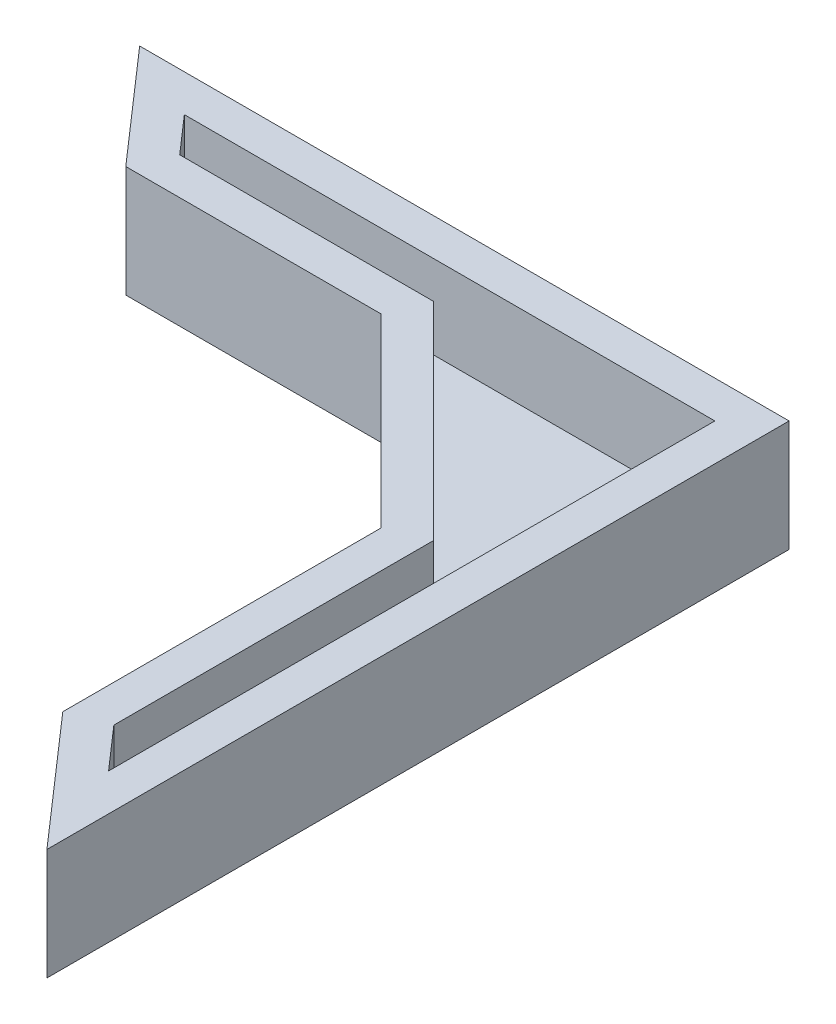
ISO-10303-21;
HEADER;
FILE_DESCRIPTION(('STEP AP214'),'2;1');
FILE_NAME('part.step','',(''),(''),'','','');
FILE_SCHEMA(('AUTOMOTIVE_DESIGN { 1 0 10303 214 1 1 1 1 }'));
ENDSEC;
DATA;
#1=APPLICATION_CONTEXT('core data for automotive mechanical design processes');
#2=APPLICATION_PROTOCOL_DEFINITION('international standard','automotive_design',2000,#1);
#3=PRODUCT_CONTEXT('',#1,'mechanical');
#4=PRODUCT('Part','Part','',(#3));
#5=PRODUCT_RELATED_PRODUCT_CATEGORY('part','',(#4));
#6=PRODUCT_DEFINITION_FORMATION('','',#4);
#7=PRODUCT_DEFINITION_CONTEXT('part definition',#1,'design');
#8=PRODUCT_DEFINITION('design','',#6,#7);
#9=PRODUCT_DEFINITION_SHAPE('','',#8);
#10=(LENGTH_UNIT() NAMED_UNIT(*) SI_UNIT(.MILLI.,.METRE.));
#11=(NAMED_UNIT(*) PLANE_ANGLE_UNIT() SI_UNIT($,.RADIAN.));
#12=(NAMED_UNIT(*) SI_UNIT($,.STERADIAN.) SOLID_ANGLE_UNIT());
#13=UNCERTAINTY_MEASURE_WITH_UNIT(LENGTH_MEASURE(1.E-05),#10,'distance_accuracy_value','');
#14=(GEOMETRIC_REPRESENTATION_CONTEXT(3) GLOBAL_UNCERTAINTY_ASSIGNED_CONTEXT((#13)) GLOBAL_UNIT_ASSIGNED_CONTEXT((#10,
#11,#12)) REPRESENTATION_CONTEXT('',''));
#15=CARTESIAN_POINT('',(0.,0.,0.));
#16=DIRECTION('',(0.,0.,1.));
#17=DIRECTION('',(1.,0.,0.));
#18=AXIS2_PLACEMENT_3D('',#15,#16,#17);
#19=CARTESIAN_POINT('',(-29.75,6.,6.));
#20=DIRECTION('',(0.752576694706878,0.,-0.658504607868518));
#21=DIRECTION('',(-0.658504607868518,0.,-0.752576694706878));
#22=AXIS2_PLACEMENT_3D('',#19,#20,#21);
#23=PLANE('',#22);
#24=DIRECTION('',(0.658504607868518,0.,0.752576694706878));
#25=VECTOR('',#24,1.);
#26=CARTESIAN_POINT('',(-29.75,0.,6.));
#27=LINE('',#26,#25);
#28=CARTESIAN_POINT('',(-35.,0.,0.));
#29=VERTEX_POINT('',#28);
#30=CARTESIAN_POINT('',(-29.75,0.,6.));
#31=VERTEX_POINT('',#30);
#32=EDGE_CURVE('E152',#29,#31,#27,.T.);
#33=ORIENTED_EDGE('',*,*,#32,.T.);
#34=DIRECTION('',(0.,-1.,0.));
#35=VECTOR('',#34,1.);
#36=CARTESIAN_POINT('',(-29.75,6.,6.));
#37=LINE('',#36,#35);
#38=CARTESIAN_POINT('',(-29.75,6.,6.));
#39=VERTEX_POINT('',#38);
#40=EDGE_CURVE('E12',#39,#31,#37,.T.);
#41=ORIENTED_EDGE('',*,*,#40,.F.);
#42=DIRECTION('',(0.658504607868518,0.,0.752576694706878));
#43=VECTOR('',#42,1.);
#44=CARTESIAN_POINT('',(-29.75,6.,6.));
#45=LINE('',#44,#43);
#46=CARTESIAN_POINT('',(-35.,6.,0.));
#47=VERTEX_POINT('',#46);
#48=EDGE_CURVE('E173',#47,#39,#45,.T.);
#49=ORIENTED_EDGE('',*,*,#48,.F.);
#50=DIRECTION('',(0.,-1.,0.));
#51=VECTOR('',#50,1.);
#52=CARTESIAN_POINT('',(-35.,6.,0.));
#53=LINE('',#52,#51);
#54=EDGE_CURVE('E148',#47,#29,#53,.T.);
#55=ORIENTED_EDGE('',*,*,#54,.T.);
#56=EDGE_LOOP('',(#33,#41,#49,#55));
#57=FACE_BOUND('',#56,.T.);
#58=ADVANCED_FACE('F45',(#57),#23,.F.);
#59=CARTESIAN_POINT('',(-29.75,6.,6.));
#60=DIRECTION('',(0.,0.,-1.));
#61=DIRECTION('',(-1.,0.,0.));
#62=AXIS2_PLACEMENT_3D('',#59,#60,#61);
#63=PLANE('',#62);
#64=DIRECTION('',(1.,0.,0.));
#65=VECTOR('',#64,1.);
#66=CARTESIAN_POINT('',(-29.75,0.,6.));
#67=LINE('',#66,#65);
#68=CARTESIAN_POINT('',(-16.,0.,6.));
#69=VERTEX_POINT('',#68);
#70=EDGE_CURVE('E156',#31,#69,#67,.T.);
#71=ORIENTED_EDGE('',*,*,#70,.T.);
#72=DIRECTION('',(0.,-1.,0.));
#73=VECTOR('',#72,1.);
#74=CARTESIAN_POINT('',(-16.,6.,6.));
#75=LINE('',#74,#73);
#76=CARTESIAN_POINT('',(-16.,6.,6.));
#77=VERTEX_POINT('',#76);
#78=EDGE_CURVE('E53',#77,#69,#75,.T.);
#79=ORIENTED_EDGE('',*,*,#78,.F.);
#80=DIRECTION('',(1.,0.,0.));
#81=VECTOR('',#80,1.);
#82=CARTESIAN_POINT('',(-29.75,6.,6.));
#83=LINE('',#82,#81);
#84=EDGE_CURVE('E107',#39,#77,#83,.T.);
#85=ORIENTED_EDGE('',*,*,#84,.F.);
#86=ORIENTED_EDGE('',*,*,#40,.T.);
#87=EDGE_LOOP('',(#71,#79,#85,#86));
#88=FACE_BOUND('',#87,.T.);
#89=ADVANCED_FACE('F349',(#88),#63,.F.);
#90=CARTESIAN_POINT('',(-16.,6.,6.));
#91=DIRECTION('',(0.707106781186549,0.,-0.707106781186546));
#92=DIRECTION('',(-0.707106781186546,0.,-0.707106781186549));
#93=AXIS2_PLACEMENT_3D('',#90,#91,#92);
#94=PLANE('',#93);
#95=DIRECTION('',(0.707106781186546,0.,0.707106781186549));
#96=VECTOR('',#95,1.);
#97=CARTESIAN_POINT('',(-16.,0.,6.));
#98=LINE('',#97,#96);
#99=CARTESIAN_POINT('',(-6.,0.,16.));
#100=VERTEX_POINT('',#99);
#101=EDGE_CURVE('E160',#69,#100,#98,.T.);
#102=ORIENTED_EDGE('',*,*,#101,.T.);
#103=DIRECTION('',(0.,-1.,0.));
#104=VECTOR('',#103,1.);
#105=CARTESIAN_POINT('',(-6.,6.,16.));
#106=LINE('',#105,#104);
#107=CARTESIAN_POINT('',(-6.,6.,16.));
#108=VERTEX_POINT('',#107);
#109=EDGE_CURVE('E180',#108,#100,#106,.T.);
#110=ORIENTED_EDGE('',*,*,#109,.F.);
#111=DIRECTION('',(0.707106781186546,0.,0.707106781186549));
#112=VECTOR('',#111,1.);
#113=CARTESIAN_POINT('',(-16.,6.,6.));
#114=LINE('',#113,#112);
#115=EDGE_CURVE('E190',#77,#108,#114,.T.);
#116=ORIENTED_EDGE('',*,*,#115,.F.);
#117=ORIENTED_EDGE('',*,*,#78,.T.);
#118=EDGE_LOOP('',(#102,#110,#116,#117));
#119=FACE_BOUND('',#118,.T.);
#120=ADVANCED_FACE('F188',(#119),#94,.F.);
#121=CARTESIAN_POINT('',(-6.,6.,16.));
#122=DIRECTION('',(1.,0.,0.));
#123=DIRECTION('',(0.,0.,-1.));
#124=AXIS2_PLACEMENT_3D('',#121,#122,#123);
#125=PLANE('',#124);
#126=DIRECTION('',(0.,0.,1.));
#127=VECTOR('',#126,1.);
#128=CARTESIAN_POINT('',(-6.,0.,16.));
#129=LINE('',#128,#127);
#130=CARTESIAN_POINT('',(-6.,0.,33.1428571428571));
#131=VERTEX_POINT('',#130);
#132=EDGE_CURVE('E163',#100,#131,#129,.T.);
#133=ORIENTED_EDGE('',*,*,#132,.T.);
#134=DIRECTION('',(0.,-1.,0.));
#135=VECTOR('',#134,1.);
#136=CARTESIAN_POINT('',(-6.,6.,33.1428571428571));
#137=LINE('',#136,#135);
#138=CARTESIAN_POINT('',(-6.,6.,33.1428571428571));
#139=VERTEX_POINT('',#138);
#140=EDGE_CURVE('E141',#139,#131,#137,.T.);
#141=ORIENTED_EDGE('',*,*,#140,.F.);
#142=DIRECTION('',(0.,0.,1.));
#143=VECTOR('',#142,1.);
#144=CARTESIAN_POINT('',(-6.,6.,16.));
#145=LINE('',#144,#143);
#146=EDGE_CURVE('E127',#108,#139,#145,.T.);
#147=ORIENTED_EDGE('',*,*,#146,.F.);
#148=ORIENTED_EDGE('',*,*,#109,.T.);
#149=EDGE_LOOP('',(#133,#141,#147,#148));
#150=FACE_BOUND('',#149,.T.);
#151=ADVANCED_FACE('F196',(#150),#125,.F.);
#152=CARTESIAN_POINT('',(0.,6.,40.));
#153=DIRECTION('',(0.752576694706877,0.,-0.658504607868518));
#154=DIRECTION('',(-0.658504607868518,0.,-0.752576694706878));
#155=AXIS2_PLACEMENT_3D('',#152,#153,#154);
#156=PLANE('',#155);
#157=DIRECTION('',(0.658504607868518,0.,0.752576694706878));
#158=VECTOR('',#157,1.);
#159=CARTESIAN_POINT('',(0.,0.,40.));
#160=LINE('',#159,#158);
#161=CARTESIAN_POINT('',(0.,0.,40.));
#162=VERTEX_POINT('',#161);
#163=EDGE_CURVE('E137',#131,#162,#160,.T.);
#164=ORIENTED_EDGE('',*,*,#163,.T.);
#165=DIRECTION('',(0.,-1.,0.));
#166=VECTOR('',#165,1.);
#167=CARTESIAN_POINT('',(0.,6.,40.));
#168=LINE('',#167,#166);
#169=CARTESIAN_POINT('',(0.,6.,40.));
#170=VERTEX_POINT('',#169);
#171=EDGE_CURVE('E134',#170,#162,#168,.T.);
#172=ORIENTED_EDGE('',*,*,#171,.F.);
#173=DIRECTION('',(0.658504607868518,0.,0.752576694706878));
#174=VECTOR('',#173,1.);
#175=CARTESIAN_POINT('',(0.,6.,40.));
#176=LINE('',#175,#174);
#177=EDGE_CURVE('E120',#139,#170,#176,.T.);
#178=ORIENTED_EDGE('',*,*,#177,.F.);
#179=ORIENTED_EDGE('',*,*,#140,.T.);
#180=EDGE_LOOP('',(#164,#172,#178,#179));
#181=FACE_BOUND('',#180,.T.);
#182=ADVANCED_FACE('F135',(#181),#156,.F.);
#183=CARTESIAN_POINT('',(0.,6.,0.));
#184=DIRECTION('',(-1.,0.,0.));
#185=DIRECTION('',(0.,0.,1.));
#186=AXIS2_PLACEMENT_3D('',#183,#184,#185);
#187=PLANE('',#186);
#188=DIRECTION('',(0.,0.,-1.));
#189=VECTOR('',#188,1.);
#190=CARTESIAN_POINT('',(0.,0.,0.));
#191=LINE('',#190,#189);
#192=CARTESIAN_POINT('',(0.,0.,0.));
#193=VERTEX_POINT('',#192);
#194=EDGE_CURVE('E168',#162,#193,#191,.T.);
#195=ORIENTED_EDGE('',*,*,#194,.T.);
#196=DIRECTION('',(0.,-1.,0.));
#197=VECTOR('',#196,1.);
#198=CARTESIAN_POINT('',(0.,6.,0.));
#199=LINE('',#198,#197);
#200=CARTESIAN_POINT('',(0.,6.,0.));
#201=VERTEX_POINT('',#200);
#202=EDGE_CURVE('E142',#201,#193,#199,.T.);
#203=ORIENTED_EDGE('',*,*,#202,.F.);
#204=DIRECTION('',(0.,0.,-1.));
#205=VECTOR('',#204,1.);
#206=CARTESIAN_POINT('',(0.,6.,0.));
#207=LINE('',#206,#205);
#208=EDGE_CURVE('E124',#170,#201,#207,.T.);
#209=ORIENTED_EDGE('',*,*,#208,.F.);
#210=ORIENTED_EDGE('',*,*,#171,.T.);
#211=EDGE_LOOP('',(#195,#203,#209,#210));
#212=FACE_BOUND('',#211,.T.);
#213=ADVANCED_FACE('F144',(#212),#187,.F.);
#214=CARTESIAN_POINT('',(-35.,6.,0.));
#215=DIRECTION('',(0.,0.,1.));
#216=DIRECTION('',(1.,0.,0.));
#217=AXIS2_PLACEMENT_3D('',#214,#215,#216);
#218=PLANE('',#217);
#219=DIRECTION('',(-1.,0.,0.));
#220=VECTOR('',#219,1.);
#221=CARTESIAN_POINT('',(-35.,0.,0.));
#222=LINE('',#221,#220);
#223=EDGE_CURVE('E99',#193,#29,#222,.T.);
#224=ORIENTED_EDGE('',*,*,#223,.T.);
#225=ORIENTED_EDGE('',*,*,#54,.F.);
#226=DIRECTION('',(-1.,0.,0.));
#227=VECTOR('',#226,1.);
#228=CARTESIAN_POINT('',(-35.,6.,0.));
#229=LINE('',#228,#227);
#230=EDGE_CURVE('E69',#201,#47,#229,.T.);
#231=ORIENTED_EDGE('',*,*,#230,.F.);
#232=ORIENTED_EDGE('',*,*,#202,.T.);
#233=EDGE_LOOP('',(#224,#225,#231,#232));
#234=FACE_BOUND('',#233,.T.);
#235=ADVANCED_FACE('F356',(#234),#218,.F.);
#236=CARTESIAN_POINT('',(0.,6.,0.));
#237=DIRECTION('',(0.,-1.,0.));
#238=DIRECTION('',(0.,0.,-1.));
#239=AXIS2_PLACEMENT_3D('',#236,#237,#238);
#240=PLANE('',#239);
#241=DIRECTION('',(1.,0.,0.));
#242=VECTOR('',#241,1.);
#243=CARTESIAN_POINT('',(-28.8424635468163,6.,4.));
#244=LINE('',#243,#242);
#245=CARTESIAN_POINT('',(-28.8424635468163,6.,4.));
#246=VERTEX_POINT('',#245);
#247=CARTESIAN_POINT('',(-15.1715728752538,6.,4.));
#248=VERTEX_POINT('',#247);
#249=EDGE_CURVE('E266',#246,#248,#244,.T.);
#250=ORIENTED_EDGE('',*,*,#249,.F.);
#251=DIRECTION('',(0.658504607868518,0.,0.752576694706878));
#252=VECTOR('',#251,1.);
#253=CARTESIAN_POINT('',(-30.5924635468163,6.,2.));
#254=LINE('',#253,#252);
#255=CARTESIAN_POINT('',(-30.5924635468163,6.,2.));
#256=VERTEX_POINT('',#255);
#257=EDGE_CURVE('E262',#256,#246,#254,.T.);
#258=ORIENTED_EDGE('',*,*,#257,.F.);
#259=DIRECTION('',(-1.,0.,0.));
#260=VECTOR('',#259,1.);
#261=CARTESIAN_POINT('',(-2.,6.,2.));
#262=LINE('',#261,#260);
#263=CARTESIAN_POINT('',(-2.,6.,2.));
#264=VERTEX_POINT('',#263);
#265=EDGE_CURVE('E258',#264,#256,#262,.T.);
#266=ORIENTED_EDGE('',*,*,#265,.F.);
#267=DIRECTION('',(0.,0.,-1.));
#268=VECTOR('',#267,1.);
#269=CARTESIAN_POINT('',(-2.,6.,34.6771011963615));
#270=LINE('',#269,#268);
#271=CARTESIAN_POINT('',(-2.,6.,34.6771011963615));
#272=VERTEX_POINT('',#271);
#273=EDGE_CURVE('E60',#272,#264,#270,.T.);
#274=ORIENTED_EDGE('',*,*,#273,.F.);
#275=DIRECTION('',(0.658504607868518,0.,0.752576694706877));
#276=VECTOR('',#275,1.);
#277=CARTESIAN_POINT('',(-4.,6.,32.3913869106472));
#278=LINE('',#277,#276);
#279=CARTESIAN_POINT('',(-4.,6.,32.3913869106472));
#280=VERTEX_POINT('',#279);
#281=EDGE_CURVE('E278',#280,#272,#278,.T.);
#282=ORIENTED_EDGE('',*,*,#281,.F.);
#283=DIRECTION('',(0.,0.,1.));
#284=VECTOR('',#283,1.);
#285=CARTESIAN_POINT('',(-4.,6.,15.1715728752538));
#286=LINE('',#285,#284);
#287=CARTESIAN_POINT('',(-4.,6.,15.1715728752538));
#288=VERTEX_POINT('',#287);
#289=EDGE_CURVE('E274',#288,#280,#286,.T.);
#290=ORIENTED_EDGE('',*,*,#289,.F.);
#291=DIRECTION('',(0.707106781186547,0.,0.707106781186547));
#292=VECTOR('',#291,1.);
#293=CARTESIAN_POINT('',(-15.1715728752538,6.,4.));
#294=LINE('',#293,#292);
#295=EDGE_CURVE('E270',#248,#288,#294,.T.);
#296=ORIENTED_EDGE('',*,*,#295,.F.);
#297=EDGE_LOOP('',(#250,#258,#266,#274,#282,#290,#296));
#298=FACE_BOUND('',#297,.T.);
#299=ORIENTED_EDGE('',*,*,#48,.T.);
#300=ORIENTED_EDGE('',*,*,#84,.T.);
#301=ORIENTED_EDGE('',*,*,#115,.T.);
#302=ORIENTED_EDGE('',*,*,#146,.T.);
#303=ORIENTED_EDGE('',*,*,#177,.T.);
#304=ORIENTED_EDGE('',*,*,#208,.T.);
#305=ORIENTED_EDGE('',*,*,#230,.T.);
#306=EDGE_LOOP('',(#299,#300,#301,#302,#303,#304,#305));
#307=FACE_BOUND('',#306,.T.);
#308=ADVANCED_FACE('F122',(#298,#307),#240,.F.);
#309=CARTESIAN_POINT('',(0.,0.,0.));
#310=DIRECTION('',(0.,-1.,0.));
#311=DIRECTION('',(0.,0.,-1.));
#312=AXIS2_PLACEMENT_3D('',#309,#310,#311);
#313=PLANE('',#312);
#314=ORIENTED_EDGE('',*,*,#32,.F.);
#315=ORIENTED_EDGE('',*,*,#223,.F.);
#316=ORIENTED_EDGE('',*,*,#194,.F.);
#317=ORIENTED_EDGE('',*,*,#163,.F.);
#318=ORIENTED_EDGE('',*,*,#132,.F.);
#319=ORIENTED_EDGE('',*,*,#101,.F.);
#320=ORIENTED_EDGE('',*,*,#70,.F.);
#321=EDGE_LOOP('',(#314,#315,#316,#317,#318,#319,#320));
#322=FACE_BOUND('',#321,.T.);
#323=ADVANCED_FACE('F194',(#322),#313,.T.);
#324=CARTESIAN_POINT('',(0.,1.5,0.));
#325=DIRECTION('',(0.,-1.,0.));
#326=DIRECTION('',(0.,0.,-1.));
#327=AXIS2_PLACEMENT_3D('',#324,#325,#326);
#328=PLANE('',#327);
#329=DIRECTION('',(-1.,0.,0.));
#330=VECTOR('',#329,1.);
#331=CARTESIAN_POINT('',(-2.,1.5,2.));
#332=LINE('',#331,#330);
#333=CARTESIAN_POINT('',(-2.,1.5,2.));
#334=VERTEX_POINT('',#333);
#335=CARTESIAN_POINT('',(-30.5924635468163,1.5,2.));
#336=VERTEX_POINT('',#335);
#337=EDGE_CURVE('E208',#334,#336,#332,.T.);
#338=ORIENTED_EDGE('',*,*,#337,.T.);
#339=DIRECTION('',(0.658504607868518,0.,0.752576694706878));
#340=VECTOR('',#339,1.);
#341=CARTESIAN_POINT('',(-30.5924635468163,1.5,2.));
#342=LINE('',#341,#340);
#343=CARTESIAN_POINT('',(-28.8424635468163,1.49999999999999,4.));
#344=VERTEX_POINT('',#343);
#345=EDGE_CURVE('E214',#336,#344,#342,.T.);
#346=ORIENTED_EDGE('',*,*,#345,.T.);
#347=DIRECTION('',(1.,0.,0.));
#348=VECTOR('',#347,1.);
#349=CARTESIAN_POINT('',(-28.8424635468163,1.5,4.));
#350=LINE('',#349,#348);
#351=CARTESIAN_POINT('',(-15.1715728752538,1.5,4.));
#352=VERTEX_POINT('',#351);
#353=EDGE_CURVE('E213',#344,#352,#350,.T.);
#354=ORIENTED_EDGE('',*,*,#353,.T.);
#355=DIRECTION('',(0.707106781186548,0.,0.707106781186548));
#356=VECTOR('',#355,1.);
#357=CARTESIAN_POINT('',(-15.1715728752538,1.5,4.));
#358=LINE('',#357,#356);
#359=CARTESIAN_POINT('',(-4.,1.5,15.1715728752538));
#360=VERTEX_POINT('',#359);
#361=EDGE_CURVE('E219',#352,#360,#358,.T.);
#362=ORIENTED_EDGE('',*,*,#361,.T.);
#363=DIRECTION('',(0.,0.,1.));
#364=VECTOR('',#363,1.);
#365=CARTESIAN_POINT('',(-4.,1.5,15.1715728752538));
#366=LINE('',#365,#364);
#367=CARTESIAN_POINT('',(-4.,1.5,32.3913869106472));
#368=VERTEX_POINT('',#367);
#369=EDGE_CURVE('E224',#360,#368,#366,.T.);
#370=ORIENTED_EDGE('',*,*,#369,.T.);
#371=DIRECTION('',(0.658504607868518,0.,0.752576694706878));
#372=VECTOR('',#371,1.);
#373=CARTESIAN_POINT('',(-4.,1.5,32.3913869106472));
#374=LINE('',#373,#372);
#375=CARTESIAN_POINT('',(-2.,1.5,34.6771011963615));
#376=VERTEX_POINT('',#375);
#377=EDGE_CURVE('E229',#368,#376,#374,.T.);
#378=ORIENTED_EDGE('',*,*,#377,.T.);
#379=DIRECTION('',(0.,0.,-1.));
#380=VECTOR('',#379,1.);
#381=CARTESIAN_POINT('',(-2.,1.5,34.6771011963615));
#382=LINE('',#381,#380);
#383=EDGE_CURVE('E233',#376,#334,#382,.T.);
#384=ORIENTED_EDGE('',*,*,#383,.T.);
#385=EDGE_LOOP('',(#338,#346,#354,#362,#370,#378,#384));
#386=FACE_BOUND('',#385,.T.);
#387=ADVANCED_FACE('F337',(#386),#328,.F.);
#388=CARTESIAN_POINT('',(-30.5924635468163,-43.4202938068511,2.));
#389=DIRECTION('',(-0.752576694706878,0.,0.658504607868517));
#390=DIRECTION('',(0.658504607868518,0.,0.752576694706878));
#391=AXIS2_PLACEMENT_3D('',#388,#389,#390);
#392=PLANE('',#391);
#393=DIRECTION('',(0.,1.,0.));
#394=VECTOR('',#393,1.);
#395=CARTESIAN_POINT('',(-30.5924635468163,-43.4202938068511,2.));
#396=LINE('',#395,#394);
#397=EDGE_CURVE('E157',#336,#256,#396,.T.);
#398=ORIENTED_EDGE('',*,*,#397,.T.);
#399=ORIENTED_EDGE('',*,*,#257,.T.);
#400=DIRECTION('',(0.,1.,0.));
#401=VECTOR('',#400,1.);
#402=CARTESIAN_POINT('',(-28.8424635468163,-43.4202938068511,4.));
#403=LINE('',#402,#401);
#404=EDGE_CURVE('E209',#344,#246,#403,.T.);
#405=ORIENTED_EDGE('',*,*,#404,.F.);
#406=ORIENTED_EDGE('',*,*,#345,.F.);
#407=EDGE_LOOP('',(#398,#399,#405,#406));
#408=FACE_BOUND('',#407,.T.);
#409=ADVANCED_FACE('F333',(#408),#392,.F.);
#410=CARTESIAN_POINT('',(-28.8424635468163,-43.4202938068511,4.));
#411=DIRECTION('',(0.,0.,1.));
#412=DIRECTION('',(1.,0.,0.));
#413=AXIS2_PLACEMENT_3D('',#410,#411,#412);
#414=PLANE('',#413);
#415=ORIENTED_EDGE('',*,*,#404,.T.);
#416=ORIENTED_EDGE('',*,*,#249,.T.);
#417=DIRECTION('',(0.,1.,0.));
#418=VECTOR('',#417,1.);
#419=CARTESIAN_POINT('',(-15.1715728752538,-43.4202938068511,4.));
#420=LINE('',#419,#418);
#421=EDGE_CURVE('E215',#352,#248,#420,.T.);
#422=ORIENTED_EDGE('',*,*,#421,.F.);
#423=ORIENTED_EDGE('',*,*,#353,.F.);
#424=EDGE_LOOP('',(#415,#416,#422,#423));
#425=FACE_BOUND('',#424,.T.);
#426=ADVANCED_FACE('F331',(#425),#414,.F.);
#427=CARTESIAN_POINT('',(-15.1715728752538,-43.4202938068511,4.));
#428=DIRECTION('',(-0.707106781186547,0.,0.707106781186547));
#429=DIRECTION('',(0.707106781186548,0.,0.707106781186548));
#430=AXIS2_PLACEMENT_3D('',#427,#428,#429);
#431=PLANE('',#430);
#432=ORIENTED_EDGE('',*,*,#421,.T.);
#433=ORIENTED_EDGE('',*,*,#295,.T.);
#434=DIRECTION('',(0.,1.,0.));
#435=VECTOR('',#434,1.);
#436=CARTESIAN_POINT('',(-4.,-43.4202938068511,15.1715728752538));
#437=LINE('',#436,#435);
#438=EDGE_CURVE('E220',#360,#288,#437,.T.);
#439=ORIENTED_EDGE('',*,*,#438,.F.);
#440=ORIENTED_EDGE('',*,*,#361,.F.);
#441=EDGE_LOOP('',(#432,#433,#439,#440));
#442=FACE_BOUND('',#441,.T.);
#443=ADVANCED_FACE('F334',(#442),#431,.F.);
#444=CARTESIAN_POINT('',(-4.,-43.4202938068511,15.1715728752538));
#445=DIRECTION('',(-1.,0.,0.));
#446=DIRECTION('',(0.,0.,1.));
#447=AXIS2_PLACEMENT_3D('',#444,#445,#446);
#448=PLANE('',#447);
#449=ORIENTED_EDGE('',*,*,#438,.T.);
#450=ORIENTED_EDGE('',*,*,#289,.T.);
#451=DIRECTION('',(0.,1.,0.));
#452=VECTOR('',#451,1.);
#453=CARTESIAN_POINT('',(-4.,-43.4202938068511,32.3913869106472));
#454=LINE('',#453,#452);
#455=EDGE_CURVE('E225',#368,#280,#454,.T.);
#456=ORIENTED_EDGE('',*,*,#455,.F.);
#457=ORIENTED_EDGE('',*,*,#369,.F.);
#458=EDGE_LOOP('',(#449,#450,#456,#457));
#459=FACE_BOUND('',#458,.T.);
#460=ADVANCED_FACE('F346',(#459),#448,.F.);
#461=CARTESIAN_POINT('',(-4.,-43.4202938068511,32.3913869106472));
#462=DIRECTION('',(-0.752576694706877,0.,0.658504607868518));
#463=DIRECTION('',(0.658504607868518,0.,0.752576694706878));
#464=AXIS2_PLACEMENT_3D('',#461,#462,#463);
#465=PLANE('',#464);
#466=ORIENTED_EDGE('',*,*,#455,.T.);
#467=ORIENTED_EDGE('',*,*,#281,.T.);
#468=DIRECTION('',(0.,1.,0.));
#469=VECTOR('',#468,1.);
#470=CARTESIAN_POINT('',(-2.,-43.4202938068511,34.6771011963615));
#471=LINE('',#470,#469);
#472=EDGE_CURVE('E230',#376,#272,#471,.T.);
#473=ORIENTED_EDGE('',*,*,#472,.F.);
#474=ORIENTED_EDGE('',*,*,#377,.F.);
#475=EDGE_LOOP('',(#466,#467,#473,#474));
#476=FACE_BOUND('',#475,.T.);
#477=ADVANCED_FACE('F287',(#476),#465,.F.);
#478=CARTESIAN_POINT('',(-2.,-43.4202938068511,34.6771011963615));
#479=DIRECTION('',(1.,0.,0.));
#480=DIRECTION('',(0.,0.,-1.));
#481=AXIS2_PLACEMENT_3D('',#478,#479,#480);
#482=PLANE('',#481);
#483=ORIENTED_EDGE('',*,*,#472,.T.);
#484=ORIENTED_EDGE('',*,*,#273,.T.);
#485=DIRECTION('',(0.,1.,0.));
#486=VECTOR('',#485,1.);
#487=CARTESIAN_POINT('',(-2.,-43.4202938068511,2.));
#488=LINE('',#487,#486);
#489=EDGE_CURVE('E234',#334,#264,#488,.T.);
#490=ORIENTED_EDGE('',*,*,#489,.F.);
#491=ORIENTED_EDGE('',*,*,#383,.F.);
#492=EDGE_LOOP('',(#483,#484,#490,#491));
#493=FACE_BOUND('',#492,.T.);
#494=ADVANCED_FACE('F338',(#493),#482,.F.);
#495=CARTESIAN_POINT('',(-2.,-43.4202938068511,2.));
#496=DIRECTION('',(0.,0.,-1.));
#497=DIRECTION('',(-1.,0.,0.));
#498=AXIS2_PLACEMENT_3D('',#495,#496,#497);
#499=PLANE('',#498);
#500=ORIENTED_EDGE('',*,*,#489,.T.);
#501=ORIENTED_EDGE('',*,*,#265,.T.);
#502=ORIENTED_EDGE('',*,*,#397,.F.);
#503=ORIENTED_EDGE('',*,*,#337,.F.);
#504=EDGE_LOOP('',(#500,#501,#502,#503));
#505=FACE_BOUND('',#504,.T.);
#506=ADVANCED_FACE('F300',(#505),#499,.F.);
#507=CLOSED_SHELL('',(#58,#89,#120,#151,#182,#213,#235,#308,#323,#387,#409,#426,#443,#460,#477,
#494,#506));
#508=MANIFOLD_SOLID_BREP('B2',#507);
#509=ADVANCED_BREP_SHAPE_REPRESENTATION('',(#18,#508),#14);
#510=SHAPE_DEFINITION_REPRESENTATION(#9,#509);
ENDSEC;
END-ISO-10303-21;
